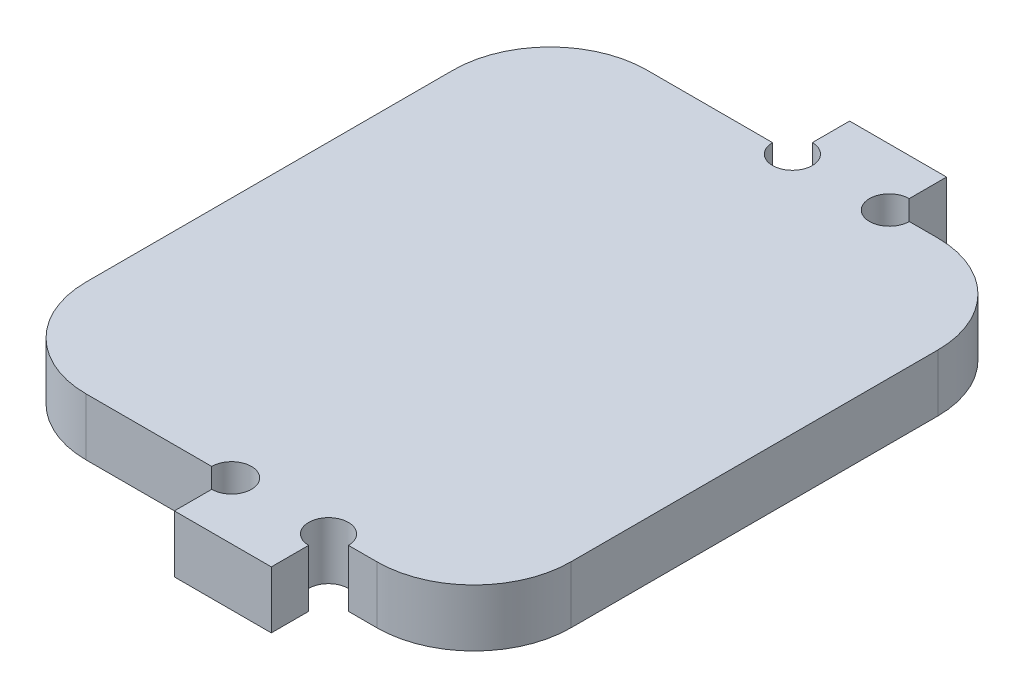
ISO-10303-21;
HEADER;
FILE_DESCRIPTION(('STEP AP214'),'2;1');
FILE_NAME('part.step','',(''),(''),'','','');
FILE_SCHEMA(('AUTOMOTIVE_DESIGN { 1 0 10303 214 1 1 1 1 }'));
ENDSEC;
DATA;
#1=APPLICATION_CONTEXT('core data for automotive mechanical design processes');
#2=APPLICATION_PROTOCOL_DEFINITION('international standard','automotive_design',2000,#1);
#3=PRODUCT_CONTEXT('',#1,'mechanical');
#4=PRODUCT('Part','Part','',(#3));
#5=PRODUCT_RELATED_PRODUCT_CATEGORY('part','',(#4));
#6=PRODUCT_DEFINITION_FORMATION('','',#4);
#7=PRODUCT_DEFINITION_CONTEXT('part definition',#1,'design');
#8=PRODUCT_DEFINITION('design','',#6,#7);
#9=PRODUCT_DEFINITION_SHAPE('','',#8);
#10=(LENGTH_UNIT() NAMED_UNIT(*) SI_UNIT(.MILLI.,.METRE.));
#11=(NAMED_UNIT(*) PLANE_ANGLE_UNIT() SI_UNIT($,.RADIAN.));
#12=(NAMED_UNIT(*) SI_UNIT($,.STERADIAN.) SOLID_ANGLE_UNIT());
#13=UNCERTAINTY_MEASURE_WITH_UNIT(LENGTH_MEASURE(1.E-05),#10,'distance_accuracy_value','');
#14=(GEOMETRIC_REPRESENTATION_CONTEXT(3) GLOBAL_UNCERTAINTY_ASSIGNED_CONTEXT((#13)) GLOBAL_UNIT_ASSIGNED_CONTEXT((#10,
#11,#12)) REPRESENTATION_CONTEXT('',''));
#15=CARTESIAN_POINT('',(0.,0.,0.));
#16=DIRECTION('',(0.,0.,1.));
#17=DIRECTION('',(1.,0.,0.));
#18=AXIS2_PLACEMENT_3D('',#15,#16,#17);
#19=CARTESIAN_POINT('',(1.30451205393456E-12,5.90000000000206,-28.9249999999983));
#20=DIRECTION('',(0.,0.,-0.999999999999987));
#21=DIRECTION('',(-0.999999999999933,0.,0.));
#22=AXIS2_PLACEMENT_3D('',#19,#20,#21);
#23=PLANE('',#22);
#24=DIRECTION('',(0.,1.00000000000006,0.));
#25=VECTOR('',#24,1.);
#26=CARTESIAN_POINT('',(12.0500000000005,-0.000999999998960166,-28.9249999999978));
#27=LINE('',#26,#25);
#28=CARTESIAN_POINT('',(12.0499999999998,1.346145417358E-12,-28.9249999999994));
#29=VERTEX_POINT('',#28);
#30=CARTESIAN_POINT('',(12.0499999999999,5.90000000000036,-28.9249999999995));
#31=VERTEX_POINT('',#30);
#32=EDGE_CURVE('E277',#29,#31,#27,.T.);
#33=ORIENTED_EDGE('',*,*,#32,.T.);
#34=DIRECTION('',(0.999999999999933,0.,0.));
#35=VECTOR('',#34,1.);
#36=CARTESIAN_POINT('',(1.30451205393456E-12,5.90000000000206,-28.9249999999983));
#37=LINE('',#36,#35);
#38=CARTESIAN_POINT('',(14.9999999999994,5.90000000000215,-28.9249999999997));
#39=VERTEX_POINT('',#38);
#40=EDGE_CURVE('E205',#31,#39,#37,.T.);
#41=ORIENTED_EDGE('',*,*,#40,.T.);
#42=DIRECTION('',(0.,-1.00000000000006,0.));
#43=VECTOR('',#42,1.);
#44=CARTESIAN_POINT('',(14.9999999999993,1.62370117351429E-12,-28.9249999999988));
#45=LINE('',#44,#43);
#46=CARTESIAN_POINT('',(14.9999999999993,1.62370117351429E-12,-28.9249999999988));
#47=VERTEX_POINT('',#46);
#48=EDGE_CURVE('E308',#39,#47,#45,.T.);
#49=ORIENTED_EDGE('',*,*,#48,.T.);
#50=DIRECTION('',(0.999999999999933,0.,0.));
#51=VECTOR('',#50,1.);
#52=CARTESIAN_POINT('',(-4.30211422042248E-13,2.08166817117217E-13,-28.9249999999976));
#53=LINE('',#52,#51);
#54=EDGE_CURVE('E224',#29,#47,#53,.T.);
#55=ORIENTED_EDGE('',*,*,#54,.F.);
#56=EDGE_LOOP('',(#33,#41,#49,#55));
#57=FACE_BOUND('',#56,.T.);
#58=ADVANCED_FACE('F38',(#57),#23,.T.);
#59=CARTESIAN_POINT('',(10.0000000000002,5.90000000000182,-1.30451205393456E-12));
#60=DIRECTION('',(-0.999999999999933,0.,0.));
#61=DIRECTION('',(0.,0.,0.999999999999987));
#62=AXIS2_PLACEMENT_3D('',#59,#60,#61);
#63=PLANE('',#62);
#64=DIRECTION('',(0.,0.,-0.999999999999987));
#65=VECTOR('',#64,1.);
#66=CARTESIAN_POINT('',(10.0000000000002,5.90000000000182,-1.30451205393456E-12));
#67=LINE('',#66,#65);
#68=CARTESIAN_POINT('',(10.0000000000003,5.90000000000088,-30.9749999999972));
#69=VERTEX_POINT('',#68);
#70=CARTESIAN_POINT('',(10.000000000001,5.90000000000045,-34.8249999999974));
#71=VERTEX_POINT('',#70);
#72=EDGE_CURVE('E257',#69,#71,#67,.T.);
#73=ORIENTED_EDGE('',*,*,#72,.F.);
#74=DIRECTION('',(0.,1.00000000000006,0.));
#75=VECTOR('',#74,1.);
#76=CARTESIAN_POINT('',(9.99999999999886,-0.0010000000002508,-30.9749999999982));
#77=LINE('',#76,#75);
#78=CARTESIAN_POINT('',(9.99999999999991,-1.52655665885959E-13,-30.9749999999988));
#79=VERTEX_POINT('',#78);
#80=EDGE_CURVE('E267',#79,#69,#77,.T.);
#81=ORIENTED_EDGE('',*,*,#80,.F.);
#82=DIRECTION('',(0.,0.,-0.999999999999987));
#83=VECTOR('',#82,1.);
#84=CARTESIAN_POINT('',(9.99999999999943,8.88178419700125E-13,-2.41473507855972E-12));
#85=LINE('',#84,#83);
#86=CARTESIAN_POINT('',(9.99999999999955,8.74300631892311E-13,-34.8249999999975));
#87=VERTEX_POINT('',#86);
#88=EDGE_CURVE('E230',#79,#87,#85,.T.);
#89=ORIENTED_EDGE('',*,*,#88,.T.);
#90=DIRECTION('',(0.,-1.00000000000006,0.));
#91=VECTOR('',#90,1.);
#92=CARTESIAN_POINT('',(10.000000000001,5.90000000000045,-34.8249999999974));
#93=LINE('',#92,#91);
#94=EDGE_CURVE('E305',#71,#87,#93,.T.);
#95=ORIENTED_EDGE('',*,*,#94,.F.);
#96=EDGE_LOOP('',(#73,#81,#89,#95));
#97=FACE_BOUND('',#96,.T.);
#98=ADVANCED_FACE('F366',(#97),#63,.F.);
#99=CARTESIAN_POINT('',(1.13797860024079E-12,5.89999999999991,-34.8249999999974));
#100=DIRECTION('',(0.,0.,-0.999999999999987));
#101=DIRECTION('',(-0.999999999999933,0.,0.));
#102=AXIS2_PLACEMENT_3D('',#99,#100,#101);
#103=PLANE('',#102);
#104=DIRECTION('',(0.999999999999933,0.,0.));
#105=VECTOR('',#104,1.);
#106=CARTESIAN_POINT('',(-1.01307850997046E-12,1.72084568816899E-12,-34.8249999999995));
#107=LINE('',#106,#105);
#108=CARTESIAN_POINT('',(-1.01307850997046E-12,1.72084568816899E-12,-34.8249999999995));
#109=VERTEX_POINT('',#108);
#110=EDGE_CURVE('E227',#109,#87,#107,.T.);
#111=ORIENTED_EDGE('',*,*,#110,.F.);
#112=DIRECTION('',(0.,-1.00000000000006,0.));
#113=VECTOR('',#112,1.);
#114=CARTESIAN_POINT('',(1.13797860024079E-12,5.89999999999991,-34.8249999999974));
#115=LINE('',#114,#113);
#116=CARTESIAN_POINT('',(1.13797860024079E-12,5.89999999999991,-34.8249999999974));
#117=VERTEX_POINT('',#116);
#118=EDGE_CURVE('E300',#117,#109,#115,.T.);
#119=ORIENTED_EDGE('',*,*,#118,.F.);
#120=DIRECTION('',(0.999999999999933,0.,0.));
#121=VECTOR('',#120,1.);
#122=CARTESIAN_POINT('',(1.13797860024079E-12,5.89999999999991,-34.8249999999974));
#123=LINE('',#122,#121);
#124=EDGE_CURVE('E254',#117,#71,#123,.T.);
#125=ORIENTED_EDGE('',*,*,#124,.T.);
#126=ORIENTED_EDGE('',*,*,#94,.T.);
#127=EDGE_LOOP('',(#111,#119,#125,#126));
#128=FACE_BOUND('',#127,.T.);
#129=ADVANCED_FACE('F373',(#128),#103,.T.);
#130=CARTESIAN_POINT('',(5.96744875736022E-13,5.90000000000095,3.94129173741931E-12));
#131=DIRECTION('',(-0.999999999999933,0.,0.));
#132=DIRECTION('',(0.,0.,0.999999999999987));
#133=AXIS2_PLACEMENT_3D('',#130,#131,#132);
#134=PLANE('',#133);
#135=DIRECTION('',(0.,1.00000000000006,0.));
#136=VECTOR('',#135,1.);
#137=CARTESIAN_POINT('',(-5.68989300120393E-13,-0.00100000000022304,-30.9749999999985));
#138=LINE('',#137,#136);
#139=CARTESIAN_POINT('',(-4.02455846426619E-13,-9.99200722162641E-13,-30.9749999999988));
#140=VERTEX_POINT('',#139);
#141=CARTESIAN_POINT('',(3.88578058618805E-13,5.9000000000024,-30.9749999999987));
#142=VERTEX_POINT('',#141);
#143=EDGE_CURVE('E53',#140,#142,#138,.T.);
#144=ORIENTED_EDGE('',*,*,#143,.T.);
#145=DIRECTION('',(0.,0.,-0.999999999999987));
#146=VECTOR('',#145,1.);
#147=CARTESIAN_POINT('',(5.96744875736022E-13,5.90000000000095,3.94129173741931E-12));
#148=LINE('',#147,#146);
#149=EDGE_CURVE('E252',#142,#117,#148,.T.);
#150=ORIENTED_EDGE('',*,*,#149,.T.);
#151=ORIENTED_EDGE('',*,*,#118,.T.);
#152=DIRECTION('',(0.,0.,-0.999999999999987));
#153=VECTOR('',#152,1.);
#154=CARTESIAN_POINT('',(0.,0.,0.));
#155=LINE('',#154,#153);
#156=EDGE_CURVE('E222',#140,#109,#155,.T.);
#157=ORIENTED_EDGE('',*,*,#156,.F.);
#158=EDGE_LOOP('',(#144,#150,#151,#157));
#159=FACE_BOUND('',#158,.T.);
#160=ADVANCED_FACE('F378',(#159),#134,.T.);
#161=DIRECTION('',(0.,1.00000000000006,0.));
#162=VECTOR('',#161,1.);
#163=CARTESIAN_POINT('',(-2.04999999999947,-0.000999999998446688,-28.9249999999974));
#164=LINE('',#163,#162);
#165=CARTESIAN_POINT('',(-2.05000000000029,5.90000000000056,-28.9249999999956));
#166=VERTEX_POINT('',#165);
#167=CARTESIAN_POINT('',(-2.05000000000105,3.7470027081099E-13,-28.9249999999972));
#168=VERTEX_POINT('',#167);
#169=EDGE_CURVE('E264',#166,#168,#164,.F.);
#170=ORIENTED_EDGE('',*,*,#169,.T.);
#171=CARTESIAN_POINT('',(-14.9999999999979,1.31838984174237E-12,-28.924999999997));
#172=VERTEX_POINT('',#171);
#173=EDGE_CURVE('E219',#172,#168,#53,.T.);
#174=ORIENTED_EDGE('',*,*,#173,.F.);
#175=DIRECTION('',(0.,-1.00000000000006,0.));
#176=VECTOR('',#175,1.);
#177=CARTESIAN_POINT('',(-14.9999999999993,5.90000000000068,-28.9249999999952));
#178=LINE('',#177,#176);
#179=CARTESIAN_POINT('',(-14.9999999999993,5.90000000000068,-28.9249999999952));
#180=VERTEX_POINT('',#179);
#181=EDGE_CURVE('E11',#172,#180,#178,.F.);
#182=ORIENTED_EDGE('',*,*,#181,.T.);
#183=EDGE_CURVE('E251',#180,#166,#37,.T.);
#184=ORIENTED_EDGE('',*,*,#183,.T.);
#185=EDGE_LOOP('',(#170,#174,#182,#184));
#186=FACE_BOUND('',#185,.T.);
#187=ADVANCED_FACE('F369',(#186),#23,.T.);
#188=CARTESIAN_POINT('',(-24.9999999999981,5.90000000000059,0.));
#189=DIRECTION('',(-0.999999999999933,0.,0.));
#190=DIRECTION('',(0.,0.,0.999999999999987));
#191=AXIS2_PLACEMENT_3D('',#188,#189,#190);
#192=PLANE('',#191);
#193=DIRECTION('',(0.,0.,-0.999999999999987));
#194=VECTOR('',#193,1.);
#195=CARTESIAN_POINT('',(-24.9999999999975,9.43689570931383E-13,-9.71445146547012E-13));
#196=LINE('',#195,#194);
#197=CARTESIAN_POINT('',(-24.9999999999982,1.11022302462516E-12,18.9250000000004));
#198=VERTEX_POINT('',#197);
#199=CARTESIAN_POINT('',(-24.9999999999973,3.60822483003176E-13,-18.9249999999984));
#200=VERTEX_POINT('',#199);
#201=EDGE_CURVE('E213',#198,#200,#196,.T.);
#202=ORIENTED_EDGE('',*,*,#201,.F.);
#203=DIRECTION('',(0.,-1.00000000000006,0.));
#204=VECTOR('',#203,1.);
#205=CARTESIAN_POINT('',(-24.9999999999989,5.90000000000106,18.9249999999969));
#206=LINE('',#205,#204);
#207=CARTESIAN_POINT('',(-24.9999999999989,5.90000000000106,18.9249999999969));
#208=VERTEX_POINT('',#207);
#209=EDGE_CURVE('E46',#198,#208,#206,.F.);
#210=ORIENTED_EDGE('',*,*,#209,.T.);
#211=DIRECTION('',(0.,0.,-0.999999999999987));
#212=VECTOR('',#211,1.);
#213=CARTESIAN_POINT('',(-24.9999999999981,5.90000000000059,0.));
#214=LINE('',#213,#212);
#215=CARTESIAN_POINT('',(-25.,5.90000000000049,-18.9249999999978));
#216=VERTEX_POINT('',#215);
#217=EDGE_CURVE('E248',#208,#216,#214,.T.);
#218=ORIENTED_EDGE('',*,*,#217,.T.);
#219=DIRECTION('',(0.,-1.00000000000006,0.));
#220=VECTOR('',#219,1.);
#221=CARTESIAN_POINT('',(-25.,5.90000000000049,-18.9249999999978));
#222=LINE('',#221,#220);
#223=EDGE_CURVE('E336',#216,#200,#222,.T.);
#224=ORIENTED_EDGE('',*,*,#223,.T.);
#225=EDGE_LOOP('',(#202,#210,#218,#224));
#226=FACE_BOUND('',#225,.T.);
#227=ADVANCED_FACE('F341',(#226),#192,.T.);
#228=CARTESIAN_POINT('',(1.33226762955019E-12,5.90000000000111,28.9250000000024));
#229=DIRECTION('',(0.,0.,-0.999999999999987));
#230=DIRECTION('',(-0.999999999999933,0.,0.));
#231=AXIS2_PLACEMENT_3D('',#228,#229,#230);
#232=PLANE('',#231);
#233=DIRECTION('',(0.999999999999933,0.,0.));
#234=VECTOR('',#233,1.);
#235=CARTESIAN_POINT('',(-3.19189119579733E-13,1.41553435639707E-12,28.9250000000019));
#236=LINE('',#235,#234);
#237=CARTESIAN_POINT('',(-14.9999999999981,8.32667268468867E-13,28.9250000000029));
#238=VERTEX_POINT('',#237);
#239=CARTESIAN_POINT('',(-2.05000000000022,1.42941214420489E-12,28.925));
#240=VERTEX_POINT('',#239);
#241=EDGE_CURVE('E203',#238,#240,#236,.T.);
#242=ORIENTED_EDGE('',*,*,#241,.T.);
#243=DIRECTION('',(0.,1.00000000000006,0.));
#244=VECTOR('',#243,1.);
#245=CARTESIAN_POINT('',(-2.04999999999929,-0.000999999999556911,28.924999999999));
#246=LINE('',#245,#244);
#247=CARTESIAN_POINT('',(-2.05000000000068,5.90000000000002,28.9250000000013));
#248=VERTEX_POINT('',#247);
#249=EDGE_CURVE('E61',#248,#240,#246,.F.);
#250=ORIENTED_EDGE('',*,*,#249,.F.);
#251=DIRECTION('',(0.999999999999933,0.,0.));
#252=VECTOR('',#251,1.);
#253=CARTESIAN_POINT('',(1.33226762955019E-12,5.90000000000111,28.9250000000024));
#254=LINE('',#253,#252);
#255=CARTESIAN_POINT('',(-15.,5.89999999999999,28.925));
#256=VERTEX_POINT('',#255);
#257=EDGE_CURVE('E245',#256,#248,#254,.T.);
#258=ORIENTED_EDGE('',*,*,#257,.F.);
#259=DIRECTION('',(0.,-1.00000000000006,0.));
#260=VECTOR('',#259,1.);
#261=CARTESIAN_POINT('',(-14.9999999999981,8.32667268468867E-13,28.9250000000029));
#262=LINE('',#261,#260);
#263=EDGE_CURVE('E334',#256,#238,#262,.T.);
#264=ORIENTED_EDGE('',*,*,#263,.T.);
#265=EDGE_LOOP('',(#242,#250,#258,#264));
#266=FACE_BOUND('',#265,.T.);
#267=ADVANCED_FACE('F350',(#266),#232,.F.);
#268=CARTESIAN_POINT('',(5.96744875736022E-13,5.90000000000095,3.94129173741931E-12));
#269=DIRECTION('',(-0.999999999999933,0.,0.));
#270=DIRECTION('',(0.,0.,0.999999999999987));
#271=AXIS2_PLACEMENT_3D('',#268,#269,#270);
#272=PLANE('',#271);
#273=DIRECTION('',(0.,1.00000000000006,0.));
#274=VECTOR('',#273,1.);
#275=CARTESIAN_POINT('',(-3.60822483003176E-13,-0.000999999999917733,30.9749999999984));
#276=LINE('',#275,#274);
#277=CARTESIAN_POINT('',(9.71445146547012E-13,5.90000000000268,30.9750000000019));
#278=VERTEX_POINT('',#277);
#279=CARTESIAN_POINT('',(-5.82867087928207E-13,1.5404344466674E-12,30.975000000001));
#280=VERTEX_POINT('',#279);
#281=EDGE_CURVE('E268',#278,#280,#276,.F.);
#282=ORIENTED_EDGE('',*,*,#281,.T.);
#283=DIRECTION('',(0.,0.,-0.999999999999987));
#284=VECTOR('',#283,1.);
#285=CARTESIAN_POINT('',(0.,0.,0.));
#286=LINE('',#285,#284);
#287=CARTESIAN_POINT('',(-5.68989300120393E-13,7.07767178198537E-13,34.825));
#288=VERTEX_POINT('',#287);
#289=EDGE_CURVE('E212',#288,#280,#286,.T.);
#290=ORIENTED_EDGE('',*,*,#289,.F.);
#291=DIRECTION('',(0.,-1.00000000000006,0.));
#292=VECTOR('',#291,1.);
#293=CARTESIAN_POINT('',(-1.38777878078145E-13,5.900000000002,34.8250000000007));
#294=LINE('',#293,#292);
#295=CARTESIAN_POINT('',(-1.38777878078145E-13,5.900000000002,34.8250000000007));
#296=VERTEX_POINT('',#295);
#297=EDGE_CURVE('E298',#296,#288,#294,.T.);
#298=ORIENTED_EDGE('',*,*,#297,.F.);
#299=DIRECTION('',(0.,0.,-0.999999999999987));
#300=VECTOR('',#299,1.);
#301=CARTESIAN_POINT('',(5.96744875736022E-13,5.90000000000095,3.94129173741931E-12));
#302=LINE('',#301,#300);
#303=EDGE_CURVE('E242',#296,#278,#302,.T.);
#304=ORIENTED_EDGE('',*,*,#303,.T.);
#305=EDGE_LOOP('',(#282,#290,#298,#304));
#306=FACE_BOUND('',#305,.T.);
#307=ADVANCED_FACE('F354',(#306),#272,.T.);
#308=CARTESIAN_POINT('',(-1.38777878078145E-13,5.900000000002,34.8250000000007));
#309=DIRECTION('',(0.,0.,-0.999999999999987));
#310=DIRECTION('',(-0.999999999999933,0.,0.));
#311=AXIS2_PLACEMENT_3D('',#308,#309,#310);
#312=PLANE('',#311);
#313=DIRECTION('',(0.999999999999933,0.,0.));
#314=VECTOR('',#313,1.);
#315=CARTESIAN_POINT('',(-5.68989300120393E-13,7.07767178198537E-13,34.825));
#316=LINE('',#315,#314);
#317=CARTESIAN_POINT('',(9.99999999999986,4.85722573273506E-13,34.8249999999984));
#318=VERTEX_POINT('',#317);
#319=EDGE_CURVE('E207',#288,#318,#316,.T.);
#320=ORIENTED_EDGE('',*,*,#319,.T.);
#321=DIRECTION('',(0.,-1.00000000000006,0.));
#322=VECTOR('',#321,1.);
#323=CARTESIAN_POINT('',(10.0000000000005,5.90000000000024,34.8249999999989));
#324=LINE('',#323,#322);
#325=CARTESIAN_POINT('',(10.0000000000005,5.90000000000024,34.8249999999989));
#326=VERTEX_POINT('',#325);
#327=EDGE_CURVE('E236',#326,#318,#324,.T.);
#328=ORIENTED_EDGE('',*,*,#327,.F.);
#329=DIRECTION('',(0.999999999999933,0.,0.));
#330=VECTOR('',#329,1.);
#331=CARTESIAN_POINT('',(-1.38777878078145E-13,5.900000000002,34.8250000000007));
#332=LINE('',#331,#330);
#333=EDGE_CURVE('E240',#296,#326,#332,.T.);
#334=ORIENTED_EDGE('',*,*,#333,.F.);
#335=ORIENTED_EDGE('',*,*,#297,.T.);
#336=EDGE_LOOP('',(#320,#328,#334,#335));
#337=FACE_BOUND('',#336,.T.);
#338=ADVANCED_FACE('F296',(#337),#312,.F.);
#339=CARTESIAN_POINT('',(10.0000000000002,5.90000000000182,-1.30451205393456E-12));
#340=DIRECTION('',(-0.999999999999933,0.,0.));
#341=DIRECTION('',(0.,0.,0.999999999999987));
#342=AXIS2_PLACEMENT_3D('',#339,#340,#341);
#343=PLANE('',#342);
#344=DIRECTION('',(0.,0.,-0.999999999999987));
#345=VECTOR('',#344,1.);
#346=CARTESIAN_POINT('',(9.99999999999943,8.88178419700125E-13,-2.41473507855972E-12));
#347=LINE('',#346,#345);
#348=CARTESIAN_POINT('',(10.0000000000003,1.346145417358E-12,30.9749999999979));
#349=VERTEX_POINT('',#348);
#350=EDGE_CURVE('E201',#318,#349,#347,.T.);
#351=ORIENTED_EDGE('',*,*,#350,.T.);
#352=DIRECTION('',(0.,1.00000000000006,0.));
#353=VECTOR('',#352,1.);
#354=CARTESIAN_POINT('',(9.99999999999994,-0.000999999999015677,30.9749999999934));
#355=LINE('',#354,#353);
#356=CARTESIAN_POINT('',(9.99999999999999,5.8999999999991,30.9749999999996));
#357=VERTEX_POINT('',#356);
#358=EDGE_CURVE('E179',#357,#349,#355,.F.);
#359=ORIENTED_EDGE('',*,*,#358,.F.);
#360=DIRECTION('',(0.,0.,-0.999999999999987));
#361=VECTOR('',#360,1.);
#362=CARTESIAN_POINT('',(10.0000000000002,5.90000000000182,-1.30451205393456E-12));
#363=LINE('',#362,#361);
#364=EDGE_CURVE('E237',#326,#357,#363,.T.);
#365=ORIENTED_EDGE('',*,*,#364,.F.);
#366=ORIENTED_EDGE('',*,*,#327,.T.);
#367=EDGE_LOOP('',(#351,#359,#365,#366));
#368=FACE_BOUND('',#367,.T.);
#369=ADVANCED_FACE('F287',(#368),#343,.F.);
#370=CARTESIAN_POINT('',(12.0499999999994,5.90000000000131,28.9249999999996));
#371=VERTEX_POINT('',#370);
#372=CARTESIAN_POINT('',(14.9999999999999,5.90000000000092,28.9249999999992));
#373=VERTEX_POINT('',#372);
#374=EDGE_CURVE('E192',#371,#373,#254,.T.);
#375=ORIENTED_EDGE('',*,*,#374,.F.);
#376=DIRECTION('',(0.,1.00000000000006,0.));
#377=VECTOR('',#376,1.);
#378=CARTESIAN_POINT('',(12.0500000000002,-0.000999999997669532,28.924999999999));
#379=LINE('',#378,#377);
#380=CARTESIAN_POINT('',(12.0499999999992,3.33066907387547E-13,28.9249999999992));
#381=VERTEX_POINT('',#380);
#382=EDGE_CURVE('E176',#381,#371,#379,.T.);
#383=ORIENTED_EDGE('',*,*,#382,.F.);
#384=CARTESIAN_POINT('',(15.,0.,28.925));
#385=VERTEX_POINT('',#384);
#386=EDGE_CURVE('E190',#381,#385,#236,.T.);
#387=ORIENTED_EDGE('',*,*,#386,.T.);
#388=DIRECTION('',(0.,-1.00000000000006,0.));
#389=VECTOR('',#388,1.);
#390=CARTESIAN_POINT('',(14.9999999999999,5.90000000000092,28.9249999999992));
#391=LINE('',#390,#389);
#392=EDGE_CURVE('E332',#385,#373,#391,.F.);
#393=ORIENTED_EDGE('',*,*,#392,.T.);
#394=EDGE_LOOP('',(#375,#383,#387,#393));
#395=FACE_BOUND('',#394,.T.);
#396=ADVANCED_FACE('F188',(#395),#232,.F.);
#397=CARTESIAN_POINT('',(24.9999999999999,5.90000000000139,2.692290834716E-12));
#398=DIRECTION('',(-0.999999999999933,0.,0.));
#399=DIRECTION('',(0.,0.,0.999999999999987));
#400=AXIS2_PLACEMENT_3D('',#397,#398,#399);
#401=PLANE('',#400);
#402=DIRECTION('',(0.,0.,-0.999999999999987));
#403=VECTOR('',#402,1.);
#404=CARTESIAN_POINT('',(24.9999999999986,1.77635683940025E-12,5.68989300120393E-12));
#405=LINE('',#404,#403);
#406=CARTESIAN_POINT('',(24.9999999999978,1.69309011255336E-12,18.9250000000021));
#407=VERTEX_POINT('',#406);
#408=CARTESIAN_POINT('',(24.9999999999992,-1.2490009027033E-13,-18.9249999999998));
#409=VERTEX_POINT('',#408);
#410=EDGE_CURVE('E200',#407,#409,#405,.T.);
#411=ORIENTED_EDGE('',*,*,#410,.T.);
#412=DIRECTION('',(0.,-1.00000000000006,0.));
#413=VECTOR('',#412,1.);
#414=CARTESIAN_POINT('',(25.,5.90000000000195,-18.9249999999997));
#415=LINE('',#414,#413);
#416=CARTESIAN_POINT('',(25.,5.90000000000195,-18.9249999999997));
#417=VERTEX_POINT('',#416);
#418=EDGE_CURVE('E321',#409,#417,#415,.F.);
#419=ORIENTED_EDGE('',*,*,#418,.T.);
#420=DIRECTION('',(0.,0.,-0.999999999999987));
#421=VECTOR('',#420,1.);
#422=CARTESIAN_POINT('',(24.9999999999999,5.90000000000139,2.692290834716E-12));
#423=LINE('',#422,#421);
#424=CARTESIAN_POINT('',(24.9999999999991,5.90000000000213,18.9250000000029));
#425=VERTEX_POINT('',#424);
#426=EDGE_CURVE('E233',#425,#417,#423,.T.);
#427=ORIENTED_EDGE('',*,*,#426,.F.);
#428=DIRECTION('',(0.,-1.00000000000006,0.));
#429=VECTOR('',#428,1.);
#430=CARTESIAN_POINT('',(24.9999999999991,5.90000000000213,18.9250000000029));
#431=LINE('',#430,#429);
#432=EDGE_CURVE('E318',#425,#407,#431,.T.);
#433=ORIENTED_EDGE('',*,*,#432,.T.);
#434=EDGE_LOOP('',(#411,#419,#427,#433));
#435=FACE_BOUND('',#434,.T.);
#436=ADVANCED_FACE('F413',(#435),#401,.F.);
#437=CARTESIAN_POINT('',(5.96744875736022E-13,5.90000000000095,3.94129173741931E-12));
#438=DIRECTION('',(0.,1.00000000000006,0.));
#439=DIRECTION('',(0.,0.,0.999999999999987));
#440=AXIS2_PLACEMENT_3D('',#437,#438,#439);
#441=PLANE('',#440);
#442=CARTESIAN_POINT('',(10.0000000000009,5.9000000000007,-28.9249999999973));
#443=DIRECTION('',(0.,1.00000000000006,0.));
#444=DIRECTION('',(0.,0.,0.999999999999987));
#445=AXIS2_PLACEMENT_3D('',#442,#443,#444);
#446=CIRCLE('',#445,2.05);
#447=EDGE_CURVE('E280',#69,#31,#446,.T.);
#448=ORIENTED_EDGE('',*,*,#447,.F.);
#449=ORIENTED_EDGE('',*,*,#72,.T.);
#450=ORIENTED_EDGE('',*,*,#124,.F.);
#451=ORIENTED_EDGE('',*,*,#149,.F.);
#452=CARTESIAN_POINT('',(1.30451205393456E-12,5.90000000000206,-28.9249999999983));
#453=DIRECTION('',(0.,1.00000000000006,0.));
#454=DIRECTION('',(0.,0.,0.999999999999987));
#455=AXIS2_PLACEMENT_3D('',#452,#453,#454);
#456=CIRCLE('',#455,2.05);
#457=EDGE_CURVE('E261',#166,#142,#456,.T.);
#458=ORIENTED_EDGE('',*,*,#457,.F.);
#459=ORIENTED_EDGE('',*,*,#183,.F.);
#460=CARTESIAN_POINT('',(-14.9999999999994,5.90000000000217,-18.9249999999959));
#461=DIRECTION('',(0.,1.00000000000006,0.));
#462=DIRECTION('',(0.,0.,0.999999999999987));
#463=AXIS2_PLACEMENT_3D('',#460,#461,#462);
#464=CIRCLE('',#463,10.);
#465=EDGE_CURVE('E323',#180,#216,#464,.T.);
#466=ORIENTED_EDGE('',*,*,#465,.T.);
#467=ORIENTED_EDGE('',*,*,#217,.F.);
#468=CARTESIAN_POINT('',(-14.9999999999988,5.90000000000183,18.9250000000011));
#469=DIRECTION('',(0.,1.00000000000006,0.));
#470=DIRECTION('',(0.,0.,0.999999999999987));
#471=AXIS2_PLACEMENT_3D('',#468,#469,#470);
#472=CIRCLE('',#471,10.);
#473=EDGE_CURVE('E325',#208,#256,#472,.T.);
#474=ORIENTED_EDGE('',*,*,#473,.T.);
#475=ORIENTED_EDGE('',*,*,#257,.T.);
#476=CARTESIAN_POINT('',(1.33226762955019E-12,5.90000000000111,28.9250000000024));
#477=DIRECTION('',(0.,1.00000000000006,0.));
#478=DIRECTION('',(0.,0.,0.999999999999987));
#479=AXIS2_PLACEMENT_3D('',#476,#477,#478);
#480=CIRCLE('',#479,2.05);
#481=EDGE_CURVE('E273',#278,#248,#480,.T.);
#482=ORIENTED_EDGE('',*,*,#481,.F.);
#483=ORIENTED_EDGE('',*,*,#303,.F.);
#484=ORIENTED_EDGE('',*,*,#333,.T.);
#485=ORIENTED_EDGE('',*,*,#364,.T.);
#486=CARTESIAN_POINT('',(10.0000000000008,5.90000000000188,28.9250000000013));
#487=DIRECTION('',(0.,1.00000000000006,0.));
#488=DIRECTION('',(0.,0.,0.999999999999987));
#489=AXIS2_PLACEMENT_3D('',#486,#487,#488);
#490=CIRCLE('',#489,2.05);
#491=EDGE_CURVE('E184',#371,#357,#490,.T.);
#492=ORIENTED_EDGE('',*,*,#491,.F.);
#493=ORIENTED_EDGE('',*,*,#374,.T.);
#494=CARTESIAN_POINT('',(14.9999999999997,5.9000000000011,18.9249999999994));
#495=DIRECTION('',(0.,1.00000000000006,0.));
#496=DIRECTION('',(0.,0.,0.999999999999987));
#497=AXIS2_PLACEMENT_3D('',#494,#495,#496);
#498=CIRCLE('',#497,10.);
#499=EDGE_CURVE('E327',#373,#425,#498,.T.);
#500=ORIENTED_EDGE('',*,*,#499,.T.);
#501=ORIENTED_EDGE('',*,*,#426,.T.);
#502=CARTESIAN_POINT('',(14.9999999999999,5.90000000000127,-18.9249999999997));
#503=DIRECTION('',(0.,1.00000000000006,0.));
#504=DIRECTION('',(0.,0.,0.999999999999987));
#505=AXIS2_PLACEMENT_3D('',#502,#503,#504);
#506=CIRCLE('',#505,10.);
#507=EDGE_CURVE('E329',#417,#39,#506,.T.);
#508=ORIENTED_EDGE('',*,*,#507,.T.);
#509=ORIENTED_EDGE('',*,*,#40,.F.);
#510=EDGE_LOOP('',(#448,#449,#450,#451,#458,#459,#466,#467,#474,#475,#482,#483,#484,#485,#492,
#493,#500,#501,#508,#509));
#511=FACE_BOUND('',#510,.T.);
#512=ADVANCED_FACE('F290',(#511),#441,.T.);
#513=CARTESIAN_POINT('',(0.,0.,0.));
#514=DIRECTION('',(0.,1.00000000000006,0.));
#515=DIRECTION('',(0.,0.,0.999999999999987));
#516=AXIS2_PLACEMENT_3D('',#513,#514,#515);
#517=PLANE('',#516);
#518=ORIENTED_EDGE('',*,*,#88,.F.);
#519=CARTESIAN_POINT('',(10.0000000000005,3.88578058618805E-13,-28.9249999999977));
#520=DIRECTION('',(0.,1.00000000000006,0.));
#521=DIRECTION('',(0.,0.,0.999999999999987));
#522=AXIS2_PLACEMENT_3D('',#519,#520,#521);
#523=CIRCLE('',#522,2.05);
#524=EDGE_CURVE('E271',#29,#79,#523,.F.);
#525=ORIENTED_EDGE('',*,*,#524,.F.);
#526=ORIENTED_EDGE('',*,*,#54,.T.);
#527=CARTESIAN_POINT('',(14.9999999999996,1.11022302462516E-12,-18.9249999999996));
#528=DIRECTION('',(0.,1.00000000000006,0.));
#529=DIRECTION('',(0.,0.,0.999999999999987));
#530=AXIS2_PLACEMENT_3D('',#527,#528,#529);
#531=CIRCLE('',#530,10.);
#532=EDGE_CURVE('E316',#47,#409,#531,.F.);
#533=ORIENTED_EDGE('',*,*,#532,.T.);
#534=ORIENTED_EDGE('',*,*,#410,.F.);
#535=CARTESIAN_POINT('',(15.0000000000001,4.9960036108132E-13,18.9249999999978));
#536=DIRECTION('',(0.,1.00000000000006,0.));
#537=DIRECTION('',(0.,0.,0.999999999999987));
#538=AXIS2_PLACEMENT_3D('',#535,#536,#537);
#539=CIRCLE('',#538,10.);
#540=EDGE_CURVE('E198',#407,#385,#539,.F.);
#541=ORIENTED_EDGE('',*,*,#540,.T.);
#542=ORIENTED_EDGE('',*,*,#386,.F.);
#543=CARTESIAN_POINT('',(9.99999999999911,1.51267887105178E-12,28.924999999999));
#544=DIRECTION('',(0.,1.00000000000006,0.));
#545=DIRECTION('',(0.,0.,0.999999999999987));
#546=AXIS2_PLACEMENT_3D('',#543,#544,#545);
#547=CIRCLE('',#546,2.05);
#548=EDGE_CURVE('E173',#349,#381,#547,.F.);
#549=ORIENTED_EDGE('',*,*,#548,.F.);
#550=ORIENTED_EDGE('',*,*,#350,.F.);
#551=ORIENTED_EDGE('',*,*,#319,.F.);
#552=ORIENTED_EDGE('',*,*,#289,.T.);
#553=CARTESIAN_POINT('',(-3.19189119579733E-13,1.41553435639707E-12,28.9250000000019));
#554=DIRECTION('',(0.,1.00000000000006,0.));
#555=DIRECTION('',(0.,0.,0.999999999999987));
#556=AXIS2_PLACEMENT_3D('',#553,#554,#555);
#557=CIRCLE('',#556,2.05);
#558=EDGE_CURVE('E193',#240,#280,#557,.F.);
#559=ORIENTED_EDGE('',*,*,#558,.F.);
#560=ORIENTED_EDGE('',*,*,#241,.F.);
#561=CARTESIAN_POINT('',(-14.999999999998,1.33226762955019E-12,18.9250000000034));
#562=DIRECTION('',(0.,1.00000000000006,0.));
#563=DIRECTION('',(0.,0.,0.999999999999987));
#564=AXIS2_PLACEMENT_3D('',#561,#562,#563);
#565=CIRCLE('',#564,10.);
#566=EDGE_CURVE('E313',#238,#198,#565,.F.);
#567=ORIENTED_EDGE('',*,*,#566,.T.);
#568=ORIENTED_EDGE('',*,*,#201,.T.);
#569=CARTESIAN_POINT('',(-14.9999999999984,4.16333634234434E-13,-18.9249999999977));
#570=DIRECTION('',(0.,1.00000000000006,0.));
#571=DIRECTION('',(0.,0.,0.999999999999987));
#572=AXIS2_PLACEMENT_3D('',#569,#570,#571);
#573=CIRCLE('',#572,10.);
#574=EDGE_CURVE('E311',#200,#172,#573,.F.);
#575=ORIENTED_EDGE('',*,*,#574,.T.);
#576=ORIENTED_EDGE('',*,*,#173,.T.);
#577=CARTESIAN_POINT('',(-4.30211422042248E-13,2.08166817117217E-13,-28.9249999999976));
#578=DIRECTION('',(0.,1.00000000000006,0.));
#579=DIRECTION('',(0.,0.,0.999999999999987));
#580=AXIS2_PLACEMENT_3D('',#577,#578,#579);
#581=CIRCLE('',#580,2.05);
#582=EDGE_CURVE('E232',#140,#168,#581,.F.);
#583=ORIENTED_EDGE('',*,*,#582,.F.);
#584=ORIENTED_EDGE('',*,*,#156,.T.);
#585=ORIENTED_EDGE('',*,*,#110,.T.);
#586=EDGE_LOOP('',(#518,#525,#526,#533,#534,#541,#542,#549,#550,#551,#552,#559,#560,#567,#568,
#575,#576,#583,#584,#585));
#587=FACE_BOUND('',#586,.T.);
#588=ADVANCED_FACE('F196',(#587),#517,.F.);
#589=CARTESIAN_POINT('',(14.9999999999999,5.90000000000127,-18.9249999999997));
#590=DIRECTION('',(0.,1.00000000000006,0.));
#591=DIRECTION('',(0.,0.,0.999999999999987));
#592=AXIS2_PLACEMENT_3D('',#589,#590,#591);
#593=CYLINDRICAL_SURFACE('',#592,10.);
#594=ORIENTED_EDGE('',*,*,#507,.F.);
#595=ORIENTED_EDGE('',*,*,#418,.F.);
#596=ORIENTED_EDGE('',*,*,#532,.F.);
#597=ORIENTED_EDGE('',*,*,#48,.F.);
#598=EDGE_LOOP('',(#594,#595,#596,#597));
#599=FACE_BOUND('',#598,.T.);
#600=ADVANCED_FACE('F410',(#599),#593,.T.);
#601=CARTESIAN_POINT('',(14.9999999999997,5.9000000000011,18.9249999999994));
#602=DIRECTION('',(0.,-1.00000000000006,0.));
#603=DIRECTION('',(0.,0.,-0.999999999999987));
#604=AXIS2_PLACEMENT_3D('',#601,#602,#603);
#605=CYLINDRICAL_SURFACE('',#604,10.);
#606=ORIENTED_EDGE('',*,*,#499,.F.);
#607=ORIENTED_EDGE('',*,*,#392,.F.);
#608=ORIENTED_EDGE('',*,*,#540,.F.);
#609=ORIENTED_EDGE('',*,*,#432,.F.);
#610=EDGE_LOOP('',(#606,#607,#608,#609));
#611=FACE_BOUND('',#610,.T.);
#612=ADVANCED_FACE('F417',(#611),#605,.T.);
#613=CARTESIAN_POINT('',(-14.9999999999988,5.90000000000183,18.9250000000011));
#614=DIRECTION('',(0.,1.00000000000006,0.));
#615=DIRECTION('',(0.,0.,0.999999999999987));
#616=AXIS2_PLACEMENT_3D('',#613,#614,#615);
#617=CYLINDRICAL_SURFACE('',#616,10.);
#618=ORIENTED_EDGE('',*,*,#473,.F.);
#619=ORIENTED_EDGE('',*,*,#209,.F.);
#620=ORIENTED_EDGE('',*,*,#566,.F.);
#621=ORIENTED_EDGE('',*,*,#263,.F.);
#622=EDGE_LOOP('',(#618,#619,#620,#621));
#623=FACE_BOUND('',#622,.T.);
#624=ADVANCED_FACE('F349',(#623),#617,.T.);
#625=CARTESIAN_POINT('',(-14.9999999999994,5.90000000000217,-18.9249999999959));
#626=DIRECTION('',(0.,-1.00000000000006,0.));
#627=DIRECTION('',(0.,0.,-0.999999999999987));
#628=AXIS2_PLACEMENT_3D('',#625,#626,#627);
#629=CYLINDRICAL_SURFACE('',#628,10.);
#630=ORIENTED_EDGE('',*,*,#465,.F.);
#631=ORIENTED_EDGE('',*,*,#181,.F.);
#632=ORIENTED_EDGE('',*,*,#574,.F.);
#633=ORIENTED_EDGE('',*,*,#223,.F.);
#634=EDGE_LOOP('',(#630,#631,#632,#633));
#635=FACE_BOUND('',#634,.T.);
#636=ADVANCED_FACE('F40',(#635),#629,.T.);
#637=CARTESIAN_POINT('',(-4.44089209850063E-13,-0.000999999999001799,-28.924999999997));
#638=DIRECTION('',(0.,1.00000000000006,0.));
#639=DIRECTION('',(0.,0.,0.999999999999987));
#640=AXIS2_PLACEMENT_3D('',#637,#638,#639);
#641=CYLINDRICAL_SURFACE('',#640,2.05);
#642=ORIENTED_EDGE('',*,*,#582,.T.);
#643=ORIENTED_EDGE('',*,*,#169,.F.);
#644=ORIENTED_EDGE('',*,*,#457,.T.);
#645=ORIENTED_EDGE('',*,*,#143,.F.);
#646=EDGE_LOOP('',(#642,#643,#644,#645));
#647=FACE_BOUND('',#646,.T.);
#648=ADVANCED_FACE('F393',(#647),#641,.F.);
#649=CARTESIAN_POINT('',(10.,-0.000999999999723444,28.9249999999978));
#650=DIRECTION('',(0.,1.00000000000006,0.));
#651=DIRECTION('',(0.,0.,0.999999999999987));
#652=AXIS2_PLACEMENT_3D('',#649,#650,#651);
#653=CYLINDRICAL_SURFACE('',#652,2.05);
#654=ORIENTED_EDGE('',*,*,#358,.T.);
#655=ORIENTED_EDGE('',*,*,#548,.T.);
#656=ORIENTED_EDGE('',*,*,#382,.T.);
#657=ORIENTED_EDGE('',*,*,#491,.T.);
#658=EDGE_LOOP('',(#654,#655,#656,#657));
#659=FACE_BOUND('',#658,.T.);
#660=ADVANCED_FACE('F175',(#659),#653,.F.);
#661=CARTESIAN_POINT('',(-1.5404344466674E-12,-0.0009999999992516,28.9249999999986));
#662=DIRECTION('',(0.,1.00000000000006,0.));
#663=DIRECTION('',(0.,0.,0.999999999999987));
#664=AXIS2_PLACEMENT_3D('',#661,#662,#663);
#665=CYLINDRICAL_SURFACE('',#664,2.05);
#666=ORIENTED_EDGE('',*,*,#249,.T.);
#667=ORIENTED_EDGE('',*,*,#558,.T.);
#668=ORIENTED_EDGE('',*,*,#281,.F.);
#669=ORIENTED_EDGE('',*,*,#481,.T.);
#670=EDGE_LOOP('',(#666,#667,#668,#669));
#671=FACE_BOUND('',#670,.T.);
#672=ADVANCED_FACE('F352',(#671),#665,.F.);
#673=CARTESIAN_POINT('',(9.99999999999979,-0.0009999999995014,-28.9249999999974));
#674=DIRECTION('',(0.,1.00000000000006,0.));
#675=DIRECTION('',(0.,0.,0.999999999999987));
#676=AXIS2_PLACEMENT_3D('',#673,#674,#675);
#677=CYLINDRICAL_SURFACE('',#676,2.05);
#678=ORIENTED_EDGE('',*,*,#524,.T.);
#679=ORIENTED_EDGE('',*,*,#80,.T.);
#680=ORIENTED_EDGE('',*,*,#447,.T.);
#681=ORIENTED_EDGE('',*,*,#32,.F.);
#682=EDGE_LOOP('',(#678,#679,#680,#681));
#683=FACE_BOUND('',#682,.T.);
#684=ADVANCED_FACE('F402',(#683),#677,.F.);
#685=CLOSED_SHELL('',(#58,#98,#129,#160,#187,#227,#267,#307,#338,#369,#396,#436,#512,#588,#600,
#612,#624,#636,#648,#660,#672,#684));
#686=MANIFOLD_SOLID_BREP('B2',#685);
#687=ADVANCED_BREP_SHAPE_REPRESENTATION('',(#18,#686),#14);
#688=SHAPE_DEFINITION_REPRESENTATION(#9,#687);
ENDSEC;
END-ISO-10303-21;
